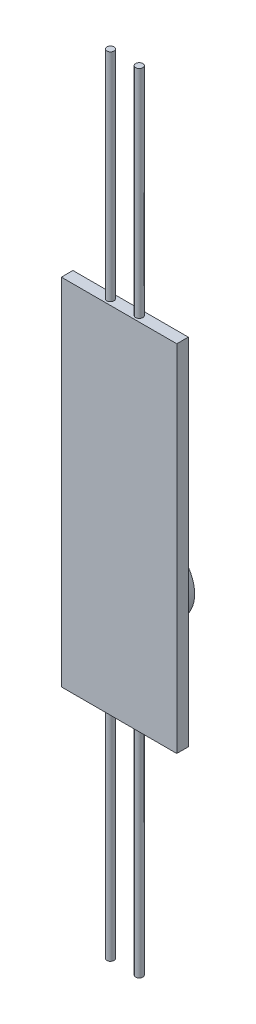
ISO-10303-21;
HEADER;
FILE_DESCRIPTION(('STEP AP214'),'2;1');
FILE_NAME('part.step','',(''),(''),'','','');
FILE_SCHEMA(('AUTOMOTIVE_DESIGN { 1 0 10303 214 1 1 1 1 }'));
ENDSEC;
DATA;
#1=APPLICATION_CONTEXT('core data for automotive mechanical design processes');
#2=APPLICATION_PROTOCOL_DEFINITION('international standard','automotive_design',2000,#1);
#3=PRODUCT_CONTEXT('',#1,'mechanical');
#4=PRODUCT('Part','Part','',(#3));
#5=PRODUCT_RELATED_PRODUCT_CATEGORY('part','',(#4));
#6=PRODUCT_DEFINITION_FORMATION('','',#4);
#7=PRODUCT_DEFINITION_CONTEXT('part definition',#1,'design');
#8=PRODUCT_DEFINITION('design','',#6,#7);
#9=PRODUCT_DEFINITION_SHAPE('','',#8);
#10=(LENGTH_UNIT() NAMED_UNIT(*) SI_UNIT(.MILLI.,.METRE.));
#11=(NAMED_UNIT(*) PLANE_ANGLE_UNIT() SI_UNIT($,.RADIAN.));
#12=(NAMED_UNIT(*) SI_UNIT($,.STERADIAN.) SOLID_ANGLE_UNIT());
#13=UNCERTAINTY_MEASURE_WITH_UNIT(LENGTH_MEASURE(1.E-05),#10,'distance_accuracy_value','');
#14=(GEOMETRIC_REPRESENTATION_CONTEXT(3) GLOBAL_UNCERTAINTY_ASSIGNED_CONTEXT((#13)) GLOBAL_UNIT_ASSIGNED_CONTEXT((#10,
#11,#12)) REPRESENTATION_CONTEXT('',''));
#15=CARTESIAN_POINT('',(0.,0.,0.));
#16=DIRECTION('',(0.,0.,1.));
#17=DIRECTION('',(1.,0.,0.));
#18=AXIS2_PLACEMENT_3D('',#15,#16,#17);
#19=CARTESIAN_POINT('',(0.,50.292,0.));
#20=DIRECTION('',(0.,-1.,0.));
#21=DIRECTION('',(0.,0.,-1.));
#22=AXIS2_PLACEMENT_3D('',#19,#20,#21);
#23=PLANE('',#22);
#24=CARTESIAN_POINT('',(-1.27,50.292,0.));
#25=DIRECTION('',(0.,-1.,0.));
#26=DIRECTION('',(0.,0.,-1.));
#27=AXIS2_PLACEMENT_3D('',#24,#25,#26);
#28=CIRCLE('',#27,0.3175);
#29=CARTESIAN_POINT('',(-1.27,50.292,-0.3175));
#30=VERTEX_POINT('',#29);
#31=EDGE_CURVE('E51',#30,#30,#28,.F.);
#32=ORIENTED_EDGE('',*,*,#31,.F.);
#33=EDGE_LOOP('',(#32));
#34=FACE_BOUND('',#33,.T.);
#35=DIRECTION('',(0.,0.,-1.));
#36=VECTOR('',#35,1.);
#37=CARTESIAN_POINT('',(5.08,50.292,0.508));
#38=LINE('',#37,#36);
#39=CARTESIAN_POINT('',(5.08,50.292,0.508));
#40=VERTEX_POINT('',#39);
#41=CARTESIAN_POINT('',(5.08,50.292,-0.508));
#42=VERTEX_POINT('',#41);
#43=EDGE_CURVE('E101',#40,#42,#38,.T.);
#44=ORIENTED_EDGE('',*,*,#43,.T.);
#45=DIRECTION('',(-1.,0.,0.));
#46=VECTOR('',#45,1.);
#47=CARTESIAN_POINT('',(-5.08,50.292,-0.508));
#48=LINE('',#47,#46);
#49=CARTESIAN_POINT('',(-5.08,50.292,-0.508));
#50=VERTEX_POINT('',#49);
#51=EDGE_CURVE('E96',#42,#50,#48,.T.);
#52=ORIENTED_EDGE('',*,*,#51,.T.);
#53=DIRECTION('',(0.,0.,1.));
#54=VECTOR('',#53,1.);
#55=CARTESIAN_POINT('',(-5.08,50.292,0.508));
#56=LINE('',#55,#54);
#57=CARTESIAN_POINT('',(-5.08,50.292,0.508));
#58=VERTEX_POINT('',#57);
#59=EDGE_CURVE('E99',#50,#58,#56,.T.);
#60=ORIENTED_EDGE('',*,*,#59,.T.);
#61=DIRECTION('',(1.,0.,0.));
#62=VECTOR('',#61,1.);
#63=CARTESIAN_POINT('',(-5.08,50.292,0.508));
#64=LINE('',#63,#62);
#65=EDGE_CURVE('E62',#58,#40,#64,.T.);
#66=ORIENTED_EDGE('',*,*,#65,.T.);
#67=EDGE_LOOP('',(#44,#52,#60,#66));
#68=FACE_BOUND('',#67,.T.);
#69=CARTESIAN_POINT('',(1.27,50.292,0.));
#70=DIRECTION('',(0.,-1.,0.));
#71=DIRECTION('',(0.,0.,-1.));
#72=AXIS2_PLACEMENT_3D('',#69,#70,#71);
#73=CIRCLE('',#72,0.3175);
#74=CARTESIAN_POINT('',(1.27,50.292,-0.3175));
#75=VERTEX_POINT('',#74);
#76=EDGE_CURVE('E11',#75,#75,#73,.F.);
#77=ORIENTED_EDGE('',*,*,#76,.F.);
#78=EDGE_LOOP('',(#77));
#79=FACE_BOUND('',#78,.T.);
#80=ADVANCED_FACE('F41',(#34,#68,#79),#23,.F.);
#81=CARTESIAN_POINT('',(-5.08,50.292,-0.508));
#82=DIRECTION('',(0.,0.,1.));
#83=DIRECTION('',(1.,0.,0.));
#84=AXIS2_PLACEMENT_3D('',#81,#82,#83);
#85=PLANE('',#84);
#86=DIRECTION('',(-1.,0.,0.));
#87=VECTOR('',#86,1.);
#88=CARTESIAN_POINT('',(-5.08,19.05,-0.508));
#89=LINE('',#88,#87);
#90=CARTESIAN_POINT('',(5.08,19.05,-0.508));
#91=VERTEX_POINT('',#90);
#92=CARTESIAN_POINT('',(-5.08,19.05,-0.508));
#93=VERTEX_POINT('',#92);
#94=EDGE_CURVE('E108',#91,#93,#89,.T.);
#95=ORIENTED_EDGE('',*,*,#94,.T.);
#96=DIRECTION('',(0.,-1.,0.));
#97=VECTOR('',#96,1.);
#98=CARTESIAN_POINT('',(-5.08,50.292,-0.508));
#99=LINE('',#98,#97);
#100=EDGE_CURVE('E105',#50,#93,#99,.T.);
#101=ORIENTED_EDGE('',*,*,#100,.F.);
#102=ORIENTED_EDGE('',*,*,#51,.F.);
#103=DIRECTION('',(0.,-1.,0.));
#104=VECTOR('',#103,1.);
#105=CARTESIAN_POINT('',(5.08,50.292,-0.508));
#106=LINE('',#105,#104);
#107=EDGE_CURVE('E110',#42,#91,#106,.T.);
#108=ORIENTED_EDGE('',*,*,#107,.T.);
#109=EDGE_LOOP('',(#95,#101,#102,#108));
#110=FACE_BOUND('',#109,.T.);
#111=CARTESIAN_POINT('',(0.,28.4464840534611,-0.508));
#112=DIRECTION('',(0.,0.,1.));
#113=DIRECTION('',(1.,0.,0.));
#114=AXIS2_PLACEMENT_3D('',#111,#112,#113);
#115=CIRCLE('',#114,3.09603755735299);
#116=CARTESIAN_POINT('',(3.09603755735299,28.4464840534611,-0.508));
#117=VERTEX_POINT('',#116);
#118=EDGE_CURVE('E149',#117,#117,#115,.F.);
#119=ORIENTED_EDGE('',*,*,#118,.F.);
#120=EDGE_LOOP('',(#119));
#121=FACE_BOUND('',#120,.T.);
#122=ADVANCED_FACE('F106',(#110,#121),#85,.F.);
#123=CARTESIAN_POINT('',(-1.27,19.05,0.));
#124=DIRECTION('',(0.,-1.,0.));
#125=DIRECTION('',(0.,0.,-1.));
#126=AXIS2_PLACEMENT_3D('',#123,#124,#125);
#127=CYLINDRICAL_SURFACE('',#126,0.3175);
#128=CARTESIAN_POINT('',(-1.27,19.05,0.));
#129=DIRECTION('',(0.,-1.,0.));
#130=DIRECTION('',(0.,0.,-1.));
#131=AXIS2_PLACEMENT_3D('',#128,#129,#130);
#132=CIRCLE('',#131,0.3175);
#133=CARTESIAN_POINT('',(-1.27,19.05,-0.3175));
#134=VERTEX_POINT('',#133);
#135=EDGE_CURVE('E138',#134,#134,#132,.F.);
#136=ORIENTED_EDGE('',*,*,#135,.F.);
#137=EDGE_LOOP('',(#136));
#138=FACE_BOUND('',#137,.T.);
#139=CARTESIAN_POINT('',(-1.27,0.,0.));
#140=DIRECTION('',(0.,-1.,0.));
#141=DIRECTION('',(0.,0.,-1.));
#142=AXIS2_PLACEMENT_3D('',#139,#140,#141);
#143=CIRCLE('',#142,0.3175);
#144=CARTESIAN_POINT('',(-1.27,0.,-0.3175));
#145=VERTEX_POINT('',#144);
#146=EDGE_CURVE('E142',#145,#145,#143,.T.);
#147=ORIENTED_EDGE('',*,*,#146,.F.);
#148=EDGE_LOOP('',(#147));
#149=FACE_BOUND('',#148,.T.);
#150=ADVANCED_FACE('F43',(#138,#149),#127,.T.);
#151=CARTESIAN_POINT('',(-1.27,0.,0.));
#152=DIRECTION('',(0.,-1.,0.));
#153=DIRECTION('',(0.,0.,-1.));
#154=AXIS2_PLACEMENT_3D('',#151,#152,#153);
#155=PLANE('',#154);
#156=ORIENTED_EDGE('',*,*,#146,.T.);
#157=EDGE_LOOP('',(#156));
#158=FACE_BOUND('',#157,.T.);
#159=ADVANCED_FACE('F179',(#158),#155,.T.);
#160=CARTESIAN_POINT('',(5.08,50.292,0.508));
#161=DIRECTION('',(-1.,0.,0.));
#162=DIRECTION('',(0.,0.,1.));
#163=AXIS2_PLACEMENT_3D('',#160,#161,#162);
#164=PLANE('',#163);
#165=DIRECTION('',(0.,0.,-1.));
#166=VECTOR('',#165,1.);
#167=CARTESIAN_POINT('',(5.08,19.05,0.508));
#168=LINE('',#167,#166);
#169=CARTESIAN_POINT('',(5.08,19.05,0.508));
#170=VERTEX_POINT('',#169);
#171=EDGE_CURVE('E122',#170,#91,#168,.T.);
#172=ORIENTED_EDGE('',*,*,#171,.T.);
#173=ORIENTED_EDGE('',*,*,#107,.F.);
#174=ORIENTED_EDGE('',*,*,#43,.F.);
#175=DIRECTION('',(0.,-1.,0.));
#176=VECTOR('',#175,1.);
#177=CARTESIAN_POINT('',(5.08,50.292,0.508));
#178=LINE('',#177,#176);
#179=EDGE_CURVE('E118',#40,#170,#178,.T.);
#180=ORIENTED_EDGE('',*,*,#179,.T.);
#181=EDGE_LOOP('',(#172,#173,#174,#180));
#182=FACE_BOUND('',#181,.T.);
#183=ADVANCED_FACE('F176',(#182),#164,.F.);
#184=CARTESIAN_POINT('',(-5.08,50.292,0.508));
#185=DIRECTION('',(1.,0.,0.));
#186=DIRECTION('',(0.,0.,-1.));
#187=AXIS2_PLACEMENT_3D('',#184,#185,#186);
#188=PLANE('',#187);
#189=DIRECTION('',(0.,0.,1.));
#190=VECTOR('',#189,1.);
#191=CARTESIAN_POINT('',(-5.08,19.05,0.508));
#192=LINE('',#191,#190);
#193=CARTESIAN_POINT('',(-5.08,19.05,0.508));
#194=VERTEX_POINT('',#193);
#195=EDGE_CURVE('E82',#93,#194,#192,.T.);
#196=ORIENTED_EDGE('',*,*,#195,.T.);
#197=DIRECTION('',(0.,-1.,0.));
#198=VECTOR('',#197,1.);
#199=CARTESIAN_POINT('',(-5.08,50.292,0.508));
#200=LINE('',#199,#198);
#201=EDGE_CURVE('E111',#58,#194,#200,.T.);
#202=ORIENTED_EDGE('',*,*,#201,.F.);
#203=ORIENTED_EDGE('',*,*,#59,.F.);
#204=ORIENTED_EDGE('',*,*,#100,.T.);
#205=EDGE_LOOP('',(#196,#202,#203,#204));
#206=FACE_BOUND('',#205,.T.);
#207=ADVANCED_FACE('F113',(#206),#188,.F.);
#208=CARTESIAN_POINT('',(-5.08,50.292,0.508));
#209=DIRECTION('',(0.,0.,-1.));
#210=DIRECTION('',(-1.,0.,0.));
#211=AXIS2_PLACEMENT_3D('',#208,#209,#210);
#212=PLANE('',#211);
#213=DIRECTION('',(1.,0.,0.));
#214=VECTOR('',#213,1.);
#215=CARTESIAN_POINT('',(-5.08,19.05,0.508));
#216=LINE('',#215,#214);
#217=EDGE_CURVE('E88',#194,#170,#216,.T.);
#218=ORIENTED_EDGE('',*,*,#217,.T.);
#219=ORIENTED_EDGE('',*,*,#179,.F.);
#220=ORIENTED_EDGE('',*,*,#65,.F.);
#221=ORIENTED_EDGE('',*,*,#201,.T.);
#222=EDGE_LOOP('',(#218,#219,#220,#221));
#223=FACE_BOUND('',#222,.T.);
#224=ADVANCED_FACE('F171',(#223),#212,.F.);
#225=CARTESIAN_POINT('',(0.,19.05,0.));
#226=DIRECTION('',(0.,-1.,0.));
#227=DIRECTION('',(0.,0.,-1.));
#228=AXIS2_PLACEMENT_3D('',#225,#226,#227);
#229=PLANE('',#228);
#230=CARTESIAN_POINT('',(1.27,19.05,0.));
#231=DIRECTION('',(0.,-1.,0.));
#232=DIRECTION('',(0.,0.,-1.));
#233=AXIS2_PLACEMENT_3D('',#230,#231,#232);
#234=CIRCLE('',#233,0.3175);
#235=CARTESIAN_POINT('',(1.27,19.05,-0.3175));
#236=VERTEX_POINT('',#235);
#237=EDGE_CURVE('E145',#236,#236,#234,.T.);
#238=ORIENTED_EDGE('',*,*,#237,.F.);
#239=EDGE_LOOP('',(#238));
#240=FACE_BOUND('',#239,.T.);
#241=ORIENTED_EDGE('',*,*,#135,.T.);
#242=EDGE_LOOP('',(#241));
#243=FACE_BOUND('',#242,.T.);
#244=ORIENTED_EDGE('',*,*,#171,.F.);
#245=ORIENTED_EDGE('',*,*,#217,.F.);
#246=ORIENTED_EDGE('',*,*,#195,.F.);
#247=ORIENTED_EDGE('',*,*,#94,.F.);
#248=EDGE_LOOP('',(#244,#245,#246,#247));
#249=FACE_BOUND('',#248,.T.);
#250=ADVANCED_FACE('F168',(#240,#243,#249),#229,.T.);
#251=CARTESIAN_POINT('',(1.27,19.05,0.));
#252=DIRECTION('',(0.,-1.,0.));
#253=DIRECTION('',(0.,0.,-1.));
#254=AXIS2_PLACEMENT_3D('',#251,#252,#253);
#255=CYLINDRICAL_SURFACE('',#254,0.3175);
#256=ORIENTED_EDGE('',*,*,#237,.T.);
#257=EDGE_LOOP('',(#256));
#258=FACE_BOUND('',#257,.T.);
#259=CARTESIAN_POINT('',(1.27,0.,0.));
#260=DIRECTION('',(0.,-1.,0.));
#261=DIRECTION('',(0.,0.,-1.));
#262=AXIS2_PLACEMENT_3D('',#259,#260,#261);
#263=CIRCLE('',#262,0.3175);
#264=CARTESIAN_POINT('',(1.27,0.,-0.3175));
#265=VERTEX_POINT('',#264);
#266=EDGE_CURVE('E125',#265,#265,#263,.T.);
#267=ORIENTED_EDGE('',*,*,#266,.F.);
#268=EDGE_LOOP('',(#267));
#269=FACE_BOUND('',#268,.T.);
#270=ADVANCED_FACE('F166',(#258,#269),#255,.T.);
#271=CARTESIAN_POINT('',(1.27,0.,0.));
#272=DIRECTION('',(0.,-1.,0.));
#273=DIRECTION('',(0.,0.,-1.));
#274=AXIS2_PLACEMENT_3D('',#271,#272,#273);
#275=PLANE('',#274);
#276=ORIENTED_EDGE('',*,*,#266,.T.);
#277=EDGE_LOOP('',(#276));
#278=FACE_BOUND('',#277,.T.);
#279=ADVANCED_FACE('F234',(#278),#275,.T.);
#280=CARTESIAN_POINT('',(0.,28.4464840534611,-3.048));
#281=DIRECTION('',(0.,0.,1.));
#282=DIRECTION('',(1.,0.,0.));
#283=AXIS2_PLACEMENT_3D('',#280,#281,#282);
#284=CYLINDRICAL_SURFACE('',#283,3.09603755735299);
#285=CARTESIAN_POINT('',(0.,28.4464840534611,-3.048));
#286=DIRECTION('',(0.,0.,-1.));
#287=DIRECTION('',(-1.,0.,0.));
#288=AXIS2_PLACEMENT_3D('',#285,#286,#287);
#289=CIRCLE('',#288,3.09603755735299);
#290=CARTESIAN_POINT('',(-3.09603755735299,28.4464840534611,-3.048));
#291=VERTEX_POINT('',#290);
#292=EDGE_CURVE('E198',#291,#291,#289,.T.);
#293=ORIENTED_EDGE('',*,*,#292,.F.);
#294=EDGE_LOOP('',(#293));
#295=FACE_BOUND('',#294,.T.);
#296=ORIENTED_EDGE('',*,*,#118,.T.);
#297=EDGE_LOOP('',(#296));
#298=FACE_BOUND('',#297,.T.);
#299=ADVANCED_FACE('F231',(#295,#298),#284,.T.);
#300=CARTESIAN_POINT('',(0.,28.4464840534611,-3.048));
#301=DIRECTION('',(0.,0.,-1.));
#302=DIRECTION('',(-1.,0.,0.));
#303=AXIS2_PLACEMENT_3D('',#300,#301,#302);
#304=PLANE('',#303);
#305=ORIENTED_EDGE('',*,*,#292,.T.);
#306=EDGE_LOOP('',(#305));
#307=FACE_BOUND('',#306,.T.);
#308=ADVANCED_FACE('F227',(#307),#304,.T.);
#309=CARTESIAN_POINT('',(-1.27,69.342,0.));
#310=DIRECTION('',(0.,-1.,0.));
#311=DIRECTION('',(0.,0.,-1.));
#312=AXIS2_PLACEMENT_3D('',#309,#310,#311);
#313=CYLINDRICAL_SURFACE('',#312,0.3175);
#314=CARTESIAN_POINT('',(-1.27,69.342,0.));
#315=DIRECTION('',(0.,1.,0.));
#316=DIRECTION('',(0.,0.,1.));
#317=AXIS2_PLACEMENT_3D('',#314,#315,#316);
#318=CIRCLE('',#317,0.3175);
#319=CARTESIAN_POINT('',(-1.27,69.342,0.3175));
#320=VERTEX_POINT('',#319);
#321=EDGE_CURVE('E202',#320,#320,#318,.T.);
#322=ORIENTED_EDGE('',*,*,#321,.F.);
#323=EDGE_LOOP('',(#322));
#324=FACE_BOUND('',#323,.T.);
#325=ORIENTED_EDGE('',*,*,#31,.T.);
#326=EDGE_LOOP('',(#325));
#327=FACE_BOUND('',#326,.T.);
#328=ADVANCED_FACE('F156',(#324,#327),#313,.T.);
#329=CARTESIAN_POINT('',(-1.27,69.342,0.));
#330=DIRECTION('',(0.,1.,0.));
#331=DIRECTION('',(0.,0.,1.));
#332=AXIS2_PLACEMENT_3D('',#329,#330,#331);
#333=PLANE('',#332);
#334=ORIENTED_EDGE('',*,*,#321,.T.);
#335=EDGE_LOOP('',(#334));
#336=FACE_BOUND('',#335,.T.);
#337=ADVANCED_FACE('F214',(#336),#333,.T.);
#338=CARTESIAN_POINT('',(1.27,69.342,0.));
#339=DIRECTION('',(0.,-1.,0.));
#340=DIRECTION('',(0.,0.,-1.));
#341=AXIS2_PLACEMENT_3D('',#338,#339,#340);
#342=CYLINDRICAL_SURFACE('',#341,0.3175);
#343=CARTESIAN_POINT('',(1.27,69.342,0.));
#344=DIRECTION('',(0.,1.,0.));
#345=DIRECTION('',(0.,0.,1.));
#346=AXIS2_PLACEMENT_3D('',#343,#344,#345);
#347=CIRCLE('',#346,0.3175);
#348=CARTESIAN_POINT('',(1.27,69.342,0.3175));
#349=VERTEX_POINT('',#348);
#350=EDGE_CURVE('E205',#349,#349,#347,.T.);
#351=ORIENTED_EDGE('',*,*,#350,.F.);
#352=EDGE_LOOP('',(#351));
#353=FACE_BOUND('',#352,.T.);
#354=ORIENTED_EDGE('',*,*,#76,.T.);
#355=EDGE_LOOP('',(#354));
#356=FACE_BOUND('',#355,.T.);
#357=ADVANCED_FACE('F211',(#353,#356),#342,.T.);
#358=CARTESIAN_POINT('',(1.27,69.342,0.));
#359=DIRECTION('',(0.,1.,0.));
#360=DIRECTION('',(0.,0.,1.));
#361=AXIS2_PLACEMENT_3D('',#358,#359,#360);
#362=PLANE('',#361);
#363=ORIENTED_EDGE('',*,*,#350,.T.);
#364=EDGE_LOOP('',(#363));
#365=FACE_BOUND('',#364,.T.);
#366=ADVANCED_FACE('F209',(#365),#362,.T.);
#367=CLOSED_SHELL('',(#80,#122,#150,#159,#183,#207,#224,#250,#270,#279,#299,#308,#328,#337,#357,#366));
#368=MANIFOLD_SOLID_BREP('B2',#367);
#369=ADVANCED_BREP_SHAPE_REPRESENTATION('',(#18,#368),#14);
#370=SHAPE_DEFINITION_REPRESENTATION(#9,#369);
ENDSEC;
END-ISO-10303-21;
